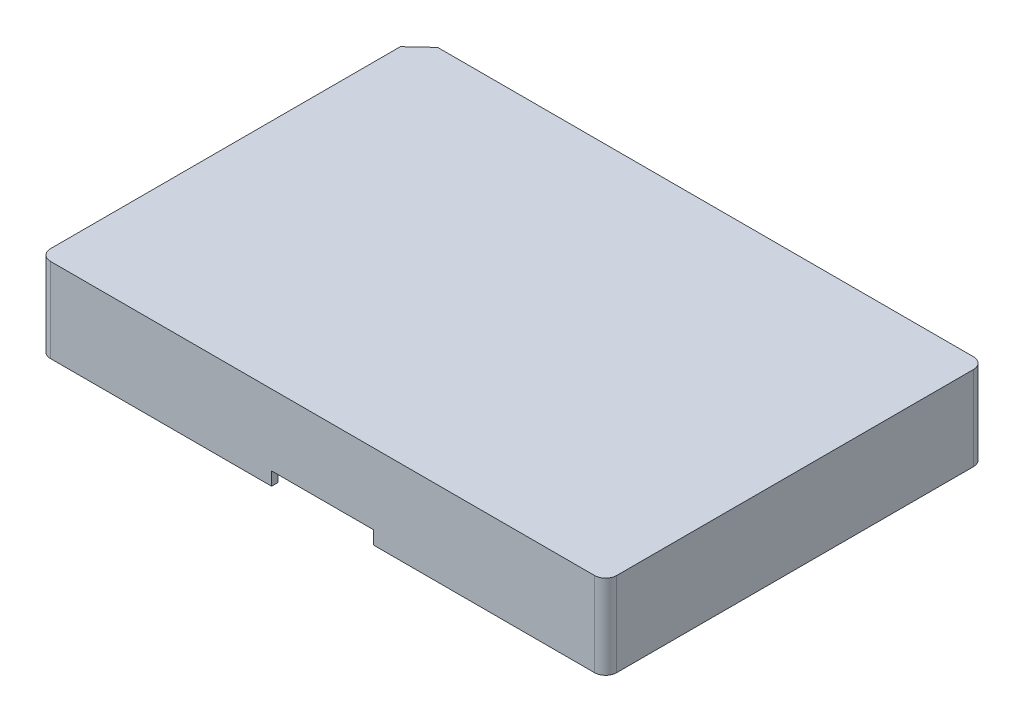
ISO-10303-21;
HEADER;
FILE_DESCRIPTION(('STEP AP214'),'2;1');
FILE_NAME('part.step','',(''),(''),'','','');
FILE_SCHEMA(('AUTOMOTIVE_DESIGN { 1 0 10303 214 1 1 1 1 }'));
ENDSEC;
DATA;
#1=APPLICATION_CONTEXT('core data for automotive mechanical design processes');
#2=APPLICATION_PROTOCOL_DEFINITION('international standard','automotive_design',2000,#1);
#3=PRODUCT_CONTEXT('',#1,'mechanical');
#4=PRODUCT('Part','Part','',(#3));
#5=PRODUCT_RELATED_PRODUCT_CATEGORY('part','',(#4));
#6=PRODUCT_DEFINITION_FORMATION('','',#4);
#7=PRODUCT_DEFINITION_CONTEXT('part definition',#1,'design');
#8=PRODUCT_DEFINITION('design','',#6,#7);
#9=PRODUCT_DEFINITION_SHAPE('','',#8);
#10=(LENGTH_UNIT() NAMED_UNIT(*) SI_UNIT(.MILLI.,.METRE.));
#11=(NAMED_UNIT(*) PLANE_ANGLE_UNIT() SI_UNIT($,.RADIAN.));
#12=(NAMED_UNIT(*) SI_UNIT($,.STERADIAN.) SOLID_ANGLE_UNIT());
#13=UNCERTAINTY_MEASURE_WITH_UNIT(LENGTH_MEASURE(1.E-05),#10,'distance_accuracy_value','');
#14=(GEOMETRIC_REPRESENTATION_CONTEXT(3) GLOBAL_UNCERTAINTY_ASSIGNED_CONTEXT((#13)) GLOBAL_UNIT_ASSIGNED_CONTEXT((#10,
#11,#12)) REPRESENTATION_CONTEXT('',''));
#15=CARTESIAN_POINT('',(0.,0.,0.));
#16=DIRECTION('',(0.,0.,1.));
#17=DIRECTION('',(1.,0.,0.));
#18=AXIS2_PLACEMENT_3D('',#15,#16,#17);
#19=CARTESIAN_POINT('',(0.,0.,0.));
#20=DIRECTION('',(0.,1.,0.));
#21=DIRECTION('',(0.,0.,1.));
#22=AXIS2_PLACEMENT_3D('',#19,#20,#21);
#23=PLANE('',#22);
#24=DIRECTION('',(0.,0.,-1.));
#25=VECTOR('',#24,1.);
#26=CARTESIAN_POINT('',(-6.91336789742875,0.,32.7853204422534));
#27=LINE('',#26,#25);
#28=CARTESIAN_POINT('',(-6.91336789742875,0.,118.285320442253));
#29=VERTEX_POINT('',#28);
#30=CARTESIAN_POINT('',(-6.91336789742875,0.,116.785320442253));
#31=VERTEX_POINT('',#30);
#32=EDGE_CURVE('E197',#29,#31,#27,.T.);
#33=ORIENTED_EDGE('',*,*,#32,.F.);
#34=DIRECTION('',(1.,0.,0.));
#35=VECTOR('',#34,1.);
#36=CARTESIAN_POINT('',(-59.2883678974287,0.,118.285320442253));
#37=LINE('',#36,#35);
#38=CARTESIAN_POINT('',(-56.7883678974287,0.,118.285320442253));
#39=VERTEX_POINT('',#38);
#40=EDGE_CURVE('E207',#39,#29,#37,.T.);
#41=ORIENTED_EDGE('',*,*,#40,.F.);
#42=CARTESIAN_POINT('',(-56.7883678974287,0.,115.785320442253));
#43=DIRECTION('',(0.,1.,0.));
#44=DIRECTION('',(0.,0.,1.));
#45=AXIS2_PLACEMENT_3D('',#42,#43,#44);
#46=CIRCLE('',#45,2.5);
#47=CARTESIAN_POINT('',(-59.2883678974287,0.,115.785320442253));
#48=VERTEX_POINT('',#47);
#49=EDGE_CURVE('E248',#39,#48,#46,.F.);
#50=ORIENTED_EDGE('',*,*,#49,.T.);
#51=DIRECTION('',(0.,0.,1.));
#52=VECTOR('',#51,1.);
#53=CARTESIAN_POINT('',(-59.2883678974288,0.,36.8507681403412));
#54=LINE('',#53,#52);
#55=CARTESIAN_POINT('',(-59.2883678974288,0.,36.8507681403412));
#56=VERTEX_POINT('',#55);
#57=EDGE_CURVE('E225',#56,#48,#54,.T.);
#58=ORIENTED_EDGE('',*,*,#57,.F.);
#59=DIRECTION('',(-0.731055268242871,0.,0.682318250360009));
#60=VECTOR('',#59,1.);
#61=CARTESIAN_POINT('',(-54.932531078049,0.,32.7853204422534));
#62=LINE('',#61,#60);
#63=CARTESIAN_POINT('',(-54.932531078049,0.,32.7853204422534));
#64=VERTEX_POINT('',#63);
#65=EDGE_CURVE('E352',#64,#56,#62,.T.);
#66=ORIENTED_EDGE('',*,*,#65,.F.);
#67=DIRECTION('',(-1.,0.,0.));
#68=VECTOR('',#67,1.);
#69=CARTESIAN_POINT('',(68.4616321025713,0.,32.7853204422534));
#70=LINE('',#69,#68);
#71=CARTESIAN_POINT('',(-6.91336789742875,0.,32.7853204422534));
#72=VERTEX_POINT('',#71);
#73=EDGE_CURVE('E223',#72,#64,#70,.T.);
#74=ORIENTED_EDGE('',*,*,#73,.F.);
#75=CARTESIAN_POINT('',(-6.91336789742875,0.,34.2853204422534));
#76=VERTEX_POINT('',#75);
#77=EDGE_CURVE('E212',#76,#72,#27,.T.);
#78=ORIENTED_EDGE('',*,*,#77,.F.);
#79=DIRECTION('',(-1.,0.,0.));
#80=VECTOR('',#79,1.);
#81=CARTESIAN_POINT('',(68.4616321025713,0.,34.2853204422534));
#82=LINE('',#81,#80);
#83=CARTESIAN_POINT('',(-54.3412863071186,0.,34.2853204422534));
#84=VERTEX_POINT('',#83);
#85=EDGE_CURVE('E358',#76,#84,#82,.T.);
#86=ORIENTED_EDGE('',*,*,#85,.T.);
#87=DIRECTION('',(-0.731055268242871,0.,0.682318250360009));
#88=VECTOR('',#87,1.);
#89=CARTESIAN_POINT('',(-53.909053702509,0.,33.8819033446177));
#90=LINE('',#89,#88);
#91=CARTESIAN_POINT('',(-57.7883678974288,0.,37.5025965932095));
#92=VERTEX_POINT('',#91);
#93=EDGE_CURVE('E310',#84,#92,#90,.T.);
#94=ORIENTED_EDGE('',*,*,#93,.T.);
#95=DIRECTION('',(0.,0.,1.));
#96=VECTOR('',#95,1.);
#97=CARTESIAN_POINT('',(-57.7883678974288,0.,36.8507681403412));
#98=LINE('',#97,#96);
#99=CARTESIAN_POINT('',(-57.7883678974287,0.,115.785320442253));
#100=VERTEX_POINT('',#99);
#101=EDGE_CURVE('E356',#92,#100,#98,.T.);
#102=ORIENTED_EDGE('',*,*,#101,.T.);
#103=CARTESIAN_POINT('',(-56.7883678974287,0.,115.785320442253));
#104=DIRECTION('',(0.,1.,0.));
#105=DIRECTION('',(0.,0.,1.));
#106=AXIS2_PLACEMENT_3D('',#103,#104,#105);
#107=CIRCLE('',#106,1.);
#108=CARTESIAN_POINT('',(-56.7883678974287,0.,116.785320442253));
#109=VERTEX_POINT('',#108);
#110=EDGE_CURVE('E327',#109,#100,#107,.F.);
#111=ORIENTED_EDGE('',*,*,#110,.F.);
#112=DIRECTION('',(1.,0.,0.));
#113=VECTOR('',#112,1.);
#114=CARTESIAN_POINT('',(-59.2883678974287,0.,116.785320442253));
#115=LINE('',#114,#113);
#116=EDGE_CURVE('E210',#109,#31,#115,.T.);
#117=ORIENTED_EDGE('',*,*,#116,.T.);
#118=EDGE_LOOP('',(#33,#41,#50,#58,#66,#74,#78,#86,#94,#102,#111,#117));
#119=FACE_BOUND('',#118,.T.);
#120=ADVANCED_FACE('F34',(#119),#23,.F.);
#121=CARTESIAN_POINT('',(-59.2883678974287,19.,118.285320442253));
#122=DIRECTION('',(0.,0.,-1.));
#123=DIRECTION('',(-1.,0.,0.));
#124=AXIS2_PLACEMENT_3D('',#121,#122,#123);
#125=PLANE('',#124);
#126=DIRECTION('',(0.,-1.,0.));
#127=VECTOR('',#126,1.);
#128=CARTESIAN_POINT('',(-6.91336789742875,3.,118.285320442253));
#129=LINE('',#128,#127);
#130=CARTESIAN_POINT('',(-6.91336789742875,3.,118.285320442253));
#131=VERTEX_POINT('',#130);
#132=EDGE_CURVE('E194',#131,#29,#129,.T.);
#133=ORIENTED_EDGE('',*,*,#132,.F.);
#134=DIRECTION('',(1.,0.,0.));
#135=VECTOR('',#134,1.);
#136=CARTESIAN_POINT('',(-6.91336789742875,3.,118.285320442253));
#137=LINE('',#136,#135);
#138=CARTESIAN_POINT('',(16.0866321025713,3.00000000000001,118.285320442253));
#139=VERTEX_POINT('',#138);
#140=EDGE_CURVE('E289',#131,#139,#137,.T.);
#141=ORIENTED_EDGE('',*,*,#140,.T.);
#142=DIRECTION('',(0.,-1.,0.));
#143=VECTOR('',#142,1.);
#144=CARTESIAN_POINT('',(16.0866321025713,3.00000000000001,118.285320442253));
#145=LINE('',#144,#143);
#146=CARTESIAN_POINT('',(16.0866321025713,0.,118.285320442253));
#147=VERTEX_POINT('',#146);
#148=EDGE_CURVE('E202',#139,#147,#145,.T.);
#149=ORIENTED_EDGE('',*,*,#148,.T.);
#150=CARTESIAN_POINT('',(65.9616321025712,0.,118.285320442253));
#151=VERTEX_POINT('',#150);
#152=EDGE_CURVE('E220',#147,#151,#37,.T.);
#153=ORIENTED_EDGE('',*,*,#152,.T.);
#154=DIRECTION('',(0.,-1.,0.));
#155=VECTOR('',#154,1.);
#156=CARTESIAN_POINT('',(65.9616321025712,19.,118.285320442253));
#157=LINE('',#156,#155);
#158=CARTESIAN_POINT('',(65.9616321025712,19.,118.285320442253));
#159=VERTEX_POINT('',#158);
#160=EDGE_CURVE('E240',#151,#159,#157,.F.);
#161=ORIENTED_EDGE('',*,*,#160,.T.);
#162=DIRECTION('',(1.,0.,0.));
#163=VECTOR('',#162,1.);
#164=CARTESIAN_POINT('',(-59.2883678974287,19.,118.285320442253));
#165=LINE('',#164,#163);
#166=CARTESIAN_POINT('',(-56.7883678974287,19.,118.285320442253));
#167=VERTEX_POINT('',#166);
#168=EDGE_CURVE('E376',#167,#159,#165,.T.);
#169=ORIENTED_EDGE('',*,*,#168,.F.);
#170=DIRECTION('',(0.,-1.,0.));
#171=VECTOR('',#170,1.);
#172=CARTESIAN_POINT('',(-56.7883678974287,19.,118.285320442253));
#173=LINE('',#172,#171);
#174=EDGE_CURVE('E218',#167,#39,#173,.T.);
#175=ORIENTED_EDGE('',*,*,#174,.T.);
#176=ORIENTED_EDGE('',*,*,#40,.T.);
#177=EDGE_LOOP('',(#133,#141,#149,#153,#161,#169,#175,#176));
#178=FACE_BOUND('',#177,.T.);
#179=ADVANCED_FACE('F215',(#178),#125,.F.);
#180=CARTESIAN_POINT('',(68.4616321025713,19.,32.7853204422534));
#181=DIRECTION('',(0.,0.,1.));
#182=DIRECTION('',(1.,0.,0.));
#183=AXIS2_PLACEMENT_3D('',#180,#181,#182);
#184=PLANE('',#183);
#185=DIRECTION('',(0.,1.,0.));
#186=VECTOR('',#185,1.);
#187=CARTESIAN_POINT('',(-6.91336789742875,19.,32.7853204422534));
#188=LINE('',#187,#186);
#189=CARTESIAN_POINT('',(-6.91336789742875,3.,32.7853204422534));
#190=VERTEX_POINT('',#189);
#191=EDGE_CURVE('E288',#72,#190,#188,.T.);
#192=ORIENTED_EDGE('',*,*,#191,.F.);
#193=ORIENTED_EDGE('',*,*,#73,.T.);
#194=DIRECTION('',(0.,-1.,0.));
#195=VECTOR('',#194,1.);
#196=CARTESIAN_POINT('',(-54.932531078049,19.,32.7853204422534));
#197=LINE('',#196,#195);
#198=CARTESIAN_POINT('',(-54.932531078049,19.,32.7853204422534));
#199=VERTEX_POINT('',#198);
#200=EDGE_CURVE('E233',#199,#64,#197,.T.);
#201=ORIENTED_EDGE('',*,*,#200,.F.);
#202=DIRECTION('',(-1.,0.,0.));
#203=VECTOR('',#202,1.);
#204=CARTESIAN_POINT('',(68.4616321025713,19.,32.7853204422534));
#205=LINE('',#204,#203);
#206=CARTESIAN_POINT('',(65.9616321025712,19.,32.7853204422534));
#207=VERTEX_POINT('',#206);
#208=EDGE_CURVE('E237',#207,#199,#205,.T.);
#209=ORIENTED_EDGE('',*,*,#208,.F.);
#210=DIRECTION('',(0.,-1.,0.));
#211=VECTOR('',#210,1.);
#212=CARTESIAN_POINT('',(65.9616321025712,19.,32.7853204422534));
#213=LINE('',#212,#211);
#214=CARTESIAN_POINT('',(65.9616321025712,0.,32.7853204422534));
#215=VERTEX_POINT('',#214);
#216=EDGE_CURVE('E258',#207,#215,#213,.T.);
#217=ORIENTED_EDGE('',*,*,#216,.T.);
#218=CARTESIAN_POINT('',(16.0866321025713,0.,32.7853204422534));
#219=VERTEX_POINT('',#218);
#220=EDGE_CURVE('E229',#215,#219,#70,.T.);
#221=ORIENTED_EDGE('',*,*,#220,.T.);
#222=DIRECTION('',(0.,1.,0.));
#223=VECTOR('',#222,1.);
#224=CARTESIAN_POINT('',(16.0866321025712,19.,32.7853204422534));
#225=LINE('',#224,#223);
#226=CARTESIAN_POINT('',(16.0866321025713,3.00000000000001,32.7853204422534));
#227=VERTEX_POINT('',#226);
#228=EDGE_CURVE('E305',#219,#227,#225,.T.);
#229=ORIENTED_EDGE('',*,*,#228,.T.);
#230=DIRECTION('',(-1.,0.,0.));
#231=VECTOR('',#230,1.);
#232=CARTESIAN_POINT('',(68.4616321025713,3.00000000000002,32.7853204422534));
#233=LINE('',#232,#231);
#234=EDGE_CURVE('E301',#227,#190,#233,.T.);
#235=ORIENTED_EDGE('',*,*,#234,.T.);
#236=EDGE_LOOP('',(#192,#193,#201,#209,#217,#221,#229,#235));
#237=FACE_BOUND('',#236,.T.);
#238=ADVANCED_FACE('F413',(#237),#184,.F.);
#239=CARTESIAN_POINT('',(-59.2883678974287,19.,116.785320442253));
#240=DIRECTION('',(0.,0.,-1.));
#241=DIRECTION('',(-1.,0.,0.));
#242=AXIS2_PLACEMENT_3D('',#239,#240,#241);
#243=PLANE('',#242);
#244=DIRECTION('',(1.,0.,0.));
#245=VECTOR('',#244,1.);
#246=CARTESIAN_POINT('',(-59.2883678974287,2.99999999999999,116.785320442253));
#247=LINE('',#246,#245);
#248=CARTESIAN_POINT('',(-6.91336789742875,3.,116.785320442253));
#249=VERTEX_POINT('',#248);
#250=CARTESIAN_POINT('',(16.0866321025713,3.00000000000001,116.785320442253));
#251=VERTEX_POINT('',#250);
#252=EDGE_CURVE('E211',#249,#251,#247,.T.);
#253=ORIENTED_EDGE('',*,*,#252,.F.);
#254=DIRECTION('',(0.,-1.,0.));
#255=VECTOR('',#254,1.);
#256=CARTESIAN_POINT('',(-6.91336789742874,19.,116.785320442253));
#257=LINE('',#256,#255);
#258=EDGE_CURVE('E307',#249,#31,#257,.T.);
#259=ORIENTED_EDGE('',*,*,#258,.T.);
#260=ORIENTED_EDGE('',*,*,#116,.F.);
#261=DIRECTION('',(0.,1.,0.));
#262=VECTOR('',#261,1.);
#263=CARTESIAN_POINT('',(-56.7883678974287,19.,116.785320442253));
#264=LINE('',#263,#262);
#265=CARTESIAN_POINT('',(-56.7883678974287,17.5,116.785320442253));
#266=VERTEX_POINT('',#265);
#267=EDGE_CURVE('E343',#266,#109,#264,.F.);
#268=ORIENTED_EDGE('',*,*,#267,.F.);
#269=DIRECTION('',(1.,0.,0.));
#270=VECTOR('',#269,1.);
#271=CARTESIAN_POINT('',(-59.2883678974287,17.5,116.785320442253));
#272=LINE('',#271,#270);
#273=CARTESIAN_POINT('',(65.9616321025712,17.5,116.785320442253));
#274=VERTEX_POINT('',#273);
#275=EDGE_CURVE('E330',#266,#274,#272,.T.);
#276=ORIENTED_EDGE('',*,*,#275,.T.);
#277=DIRECTION('',(0.,1.,0.));
#278=VECTOR('',#277,1.);
#279=CARTESIAN_POINT('',(65.9616321025712,19.,116.785320442253));
#280=LINE('',#279,#278);
#281=CARTESIAN_POINT('',(65.9616321025712,0.,116.785320442253));
#282=VERTEX_POINT('',#281);
#283=EDGE_CURVE('E314',#282,#274,#280,.T.);
#284=ORIENTED_EDGE('',*,*,#283,.F.);
#285=CARTESIAN_POINT('',(16.0866321025713,0.,116.785320442253));
#286=VERTEX_POINT('',#285);
#287=EDGE_CURVE('E367',#286,#282,#115,.T.);
#288=ORIENTED_EDGE('',*,*,#287,.F.);
#289=DIRECTION('',(0.,-1.,0.));
#290=VECTOR('',#289,1.);
#291=CARTESIAN_POINT('',(16.0866321025712,19.,116.785320442253));
#292=LINE('',#291,#290);
#293=EDGE_CURVE('E303',#251,#286,#292,.T.);
#294=ORIENTED_EDGE('',*,*,#293,.F.);
#295=EDGE_LOOP('',(#253,#259,#260,#268,#276,#284,#288,#294));
#296=FACE_BOUND('',#295,.T.);
#297=ADVANCED_FACE('F439',(#296),#243,.T.);
#298=CARTESIAN_POINT('',(68.4616321025713,19.,34.2853204422534));
#299=DIRECTION('',(0.,0.,1.));
#300=DIRECTION('',(1.,0.,0.));
#301=AXIS2_PLACEMENT_3D('',#298,#299,#300);
#302=PLANE('',#301);
#303=ORIENTED_EDGE('',*,*,#85,.F.);
#304=DIRECTION('',(0.,1.,0.));
#305=VECTOR('',#304,1.);
#306=CARTESIAN_POINT('',(-6.91336789742875,19.,34.2853204422534));
#307=LINE('',#306,#305);
#308=CARTESIAN_POINT('',(-6.91336789742875,3.,34.2853204422534));
#309=VERTEX_POINT('',#308);
#310=EDGE_CURVE('E11',#76,#309,#307,.T.);
#311=ORIENTED_EDGE('',*,*,#310,.T.);
#312=DIRECTION('',(-1.,0.,0.));
#313=VECTOR('',#312,1.);
#314=CARTESIAN_POINT('',(68.4616321025713,3.00000000000002,34.2853204422534));
#315=LINE('',#314,#313);
#316=CARTESIAN_POINT('',(16.0866321025712,3.00000000000001,34.2853204422534));
#317=VERTEX_POINT('',#316);
#318=EDGE_CURVE('E266',#317,#309,#315,.T.);
#319=ORIENTED_EDGE('',*,*,#318,.F.);
#320=DIRECTION('',(0.,1.,0.));
#321=VECTOR('',#320,1.);
#322=CARTESIAN_POINT('',(16.0866321025712,19.,34.2853204422534));
#323=LINE('',#322,#321);
#324=CARTESIAN_POINT('',(16.0866321025713,0.,34.2853204422534));
#325=VERTEX_POINT('',#324);
#326=EDGE_CURVE('E42',#325,#317,#323,.T.);
#327=ORIENTED_EDGE('',*,*,#326,.F.);
#328=CARTESIAN_POINT('',(65.9616321025712,0.,34.2853204422534));
#329=VERTEX_POINT('',#328);
#330=EDGE_CURVE('E320',#329,#325,#82,.T.);
#331=ORIENTED_EDGE('',*,*,#330,.F.);
#332=DIRECTION('',(0.,1.,0.));
#333=VECTOR('',#332,1.);
#334=CARTESIAN_POINT('',(65.9616321025712,19.,34.2853204422534));
#335=LINE('',#334,#333);
#336=CARTESIAN_POINT('',(65.9616321025712,17.5,34.2853204422534));
#337=VERTEX_POINT('',#336);
#338=EDGE_CURVE('E333',#337,#329,#335,.F.);
#339=ORIENTED_EDGE('',*,*,#338,.F.);
#340=DIRECTION('',(-1.,0.,0.));
#341=VECTOR('',#340,1.);
#342=CARTESIAN_POINT('',(68.4616321025713,17.5,34.2853204422534));
#343=LINE('',#342,#341);
#344=CARTESIAN_POINT('',(-54.3412863071186,17.5,34.2853204422534));
#345=VERTEX_POINT('',#344);
#346=EDGE_CURVE('E323',#337,#345,#343,.T.);
#347=ORIENTED_EDGE('',*,*,#346,.T.);
#348=DIRECTION('',(0.,-1.,0.));
#349=VECTOR('',#348,1.);
#350=CARTESIAN_POINT('',(-54.3412863071186,19.,34.2853204422534));
#351=LINE('',#350,#349);
#352=EDGE_CURVE('E315',#345,#84,#351,.T.);
#353=ORIENTED_EDGE('',*,*,#352,.T.);
#354=EDGE_LOOP('',(#303,#311,#319,#327,#331,#339,#347,#353));
#355=FACE_BOUND('',#354,.T.);
#356=ADVANCED_FACE('F278',(#355),#302,.T.);
#357=ORIENTED_EDGE('',*,*,#152,.F.);
#358=DIRECTION('',(0.,0.,-1.));
#359=VECTOR('',#358,1.);
#360=CARTESIAN_POINT('',(16.0866321025713,0.,32.7853204422534));
#361=LINE('',#360,#359);
#362=EDGE_CURVE('E297',#147,#286,#361,.T.);
#363=ORIENTED_EDGE('',*,*,#362,.T.);
#364=ORIENTED_EDGE('',*,*,#287,.T.);
#365=CARTESIAN_POINT('',(65.9616321025712,0.,115.785320442253));
#366=DIRECTION('',(0.,1.,0.));
#367=DIRECTION('',(0.,0.,1.));
#368=AXIS2_PLACEMENT_3D('',#365,#366,#367);
#369=CIRCLE('',#368,1.);
#370=CARTESIAN_POINT('',(66.9616321025712,0.,115.785320442253));
#371=VERTEX_POINT('',#370);
#372=EDGE_CURVE('E345',#371,#282,#369,.F.);
#373=ORIENTED_EDGE('',*,*,#372,.F.);
#374=DIRECTION('',(0.,0.,-1.));
#375=VECTOR('',#374,1.);
#376=CARTESIAN_POINT('',(66.9616321025712,0.,118.285320442253));
#377=LINE('',#376,#375);
#378=CARTESIAN_POINT('',(66.9616321025712,0.,35.2853204422534));
#379=VERTEX_POINT('',#378);
#380=EDGE_CURVE('E361',#371,#379,#377,.T.);
#381=ORIENTED_EDGE('',*,*,#380,.T.);
#382=CARTESIAN_POINT('',(65.9616321025712,0.,35.2853204422534));
#383=DIRECTION('',(0.,1.,0.));
#384=DIRECTION('',(0.,0.,1.));
#385=AXIS2_PLACEMENT_3D('',#382,#383,#384);
#386=CIRCLE('',#385,1.);
#387=EDGE_CURVE('E359',#329,#379,#386,.F.);
#388=ORIENTED_EDGE('',*,*,#387,.F.);
#389=ORIENTED_EDGE('',*,*,#330,.T.);
#390=EDGE_CURVE('E273',#325,#219,#361,.T.);
#391=ORIENTED_EDGE('',*,*,#390,.T.);
#392=ORIENTED_EDGE('',*,*,#220,.F.);
#393=CARTESIAN_POINT('',(65.9616321025712,0.,35.2853204422534));
#394=DIRECTION('',(0.,1.,0.));
#395=DIRECTION('',(0.,0.,1.));
#396=AXIS2_PLACEMENT_3D('',#393,#394,#395);
#397=CIRCLE('',#396,2.5);
#398=CARTESIAN_POINT('',(68.4616321025713,0.,35.2853204422534));
#399=VERTEX_POINT('',#398);
#400=EDGE_CURVE('E246',#215,#399,#397,.F.);
#401=ORIENTED_EDGE('',*,*,#400,.T.);
#402=DIRECTION('',(0.,0.,-1.));
#403=VECTOR('',#402,1.);
#404=CARTESIAN_POINT('',(68.4616321025713,0.,118.285320442253));
#405=LINE('',#404,#403);
#406=CARTESIAN_POINT('',(68.4616321025713,0.,115.785320442253));
#407=VERTEX_POINT('',#406);
#408=EDGE_CURVE('E219',#407,#399,#405,.T.);
#409=ORIENTED_EDGE('',*,*,#408,.F.);
#410=CARTESIAN_POINT('',(65.9616321025712,0.,115.785320442253));
#411=DIRECTION('',(0.,1.,0.));
#412=DIRECTION('',(0.,0.,1.));
#413=AXIS2_PLACEMENT_3D('',#410,#411,#412);
#414=CIRCLE('',#413,2.5);
#415=EDGE_CURVE('E243',#407,#151,#414,.F.);
#416=ORIENTED_EDGE('',*,*,#415,.T.);
#417=EDGE_LOOP('',(#357,#363,#364,#373,#381,#388,#389,#391,#392,#401,#409,#416));
#418=FACE_BOUND('',#417,.T.);
#419=ADVANCED_FACE('F419',(#418),#23,.F.);
#420=CARTESIAN_POINT('',(-54.932531078049,19.,32.7853204422534));
#421=DIRECTION('',(0.682318250360009,0.,0.731055268242871));
#422=DIRECTION('',(0.731055268242871,0.,-0.682318250360009));
#423=AXIS2_PLACEMENT_3D('',#420,#421,#422);
#424=PLANE('',#423);
#425=ORIENTED_EDGE('',*,*,#65,.T.);
#426=DIRECTION('',(0.,-1.,0.));
#427=VECTOR('',#426,1.);
#428=CARTESIAN_POINT('',(-59.2883678974288,19.,36.8507681403412));
#429=LINE('',#428,#427);
#430=CARTESIAN_POINT('',(-59.2883678974288,19.,36.8507681403412));
#431=VERTEX_POINT('',#430);
#432=EDGE_CURVE('E236',#431,#56,#429,.T.);
#433=ORIENTED_EDGE('',*,*,#432,.F.);
#434=DIRECTION('',(-0.731055268242871,0.,0.682318250360009));
#435=VECTOR('',#434,1.);
#436=CARTESIAN_POINT('',(-54.932531078049,19.,32.7853204422534));
#437=LINE('',#436,#435);
#438=EDGE_CURVE('E232',#199,#431,#437,.T.);
#439=ORIENTED_EDGE('',*,*,#438,.F.);
#440=ORIENTED_EDGE('',*,*,#200,.T.);
#441=EDGE_LOOP('',(#425,#433,#439,#440));
#442=FACE_BOUND('',#441,.T.);
#443=ADVANCED_FACE('F417',(#442),#424,.F.);
#444=CARTESIAN_POINT('',(-59.2883678974288,19.,36.8507681403412));
#445=DIRECTION('',(1.,0.,0.));
#446=DIRECTION('',(0.,0.,-1.));
#447=AXIS2_PLACEMENT_3D('',#444,#445,#446);
#448=PLANE('',#447);
#449=ORIENTED_EDGE('',*,*,#57,.T.);
#450=DIRECTION('',(0.,-1.,0.));
#451=VECTOR('',#450,1.);
#452=CARTESIAN_POINT('',(-59.2883678974287,19.,115.785320442253));
#453=LINE('',#452,#451);
#454=CARTESIAN_POINT('',(-59.2883678974287,19.,115.785320442253));
#455=VERTEX_POINT('',#454);
#456=EDGE_CURVE('E250',#48,#455,#453,.F.);
#457=ORIENTED_EDGE('',*,*,#456,.T.);
#458=DIRECTION('',(0.,0.,1.));
#459=VECTOR('',#458,1.);
#460=CARTESIAN_POINT('',(-59.2883678974288,19.,36.8507681403412));
#461=LINE('',#460,#459);
#462=EDGE_CURVE('E373',#431,#455,#461,.T.);
#463=ORIENTED_EDGE('',*,*,#462,.F.);
#464=ORIENTED_EDGE('',*,*,#432,.T.);
#465=EDGE_LOOP('',(#449,#457,#463,#464));
#466=FACE_BOUND('',#465,.T.);
#467=ADVANCED_FACE('F389',(#466),#448,.F.);
#468=CARTESIAN_POINT('',(68.4616321025713,19.,118.285320442253));
#469=DIRECTION('',(-1.,0.,0.));
#470=DIRECTION('',(0.,0.,1.));
#471=AXIS2_PLACEMENT_3D('',#468,#469,#470);
#472=PLANE('',#471);
#473=ORIENTED_EDGE('',*,*,#408,.T.);
#474=DIRECTION('',(0.,-1.,0.));
#475=VECTOR('',#474,1.);
#476=CARTESIAN_POINT('',(68.4616321025713,19.,35.2853204422534));
#477=LINE('',#476,#475);
#478=CARTESIAN_POINT('',(68.4616321025713,19.,35.2853204422534));
#479=VERTEX_POINT('',#478);
#480=EDGE_CURVE('E264',#399,#479,#477,.F.);
#481=ORIENTED_EDGE('',*,*,#480,.T.);
#482=DIRECTION('',(0.,0.,-1.));
#483=VECTOR('',#482,1.);
#484=CARTESIAN_POINT('',(68.4616321025713,19.,118.285320442253));
#485=LINE('',#484,#483);
#486=CARTESIAN_POINT('',(68.4616321025713,19.,115.785320442253));
#487=VERTEX_POINT('',#486);
#488=EDGE_CURVE('E379',#487,#479,#485,.T.);
#489=ORIENTED_EDGE('',*,*,#488,.F.);
#490=DIRECTION('',(0.,-1.,0.));
#491=VECTOR('',#490,1.);
#492=CARTESIAN_POINT('',(68.4616321025713,19.,115.785320442253));
#493=LINE('',#492,#491);
#494=EDGE_CURVE('E261',#487,#407,#493,.T.);
#495=ORIENTED_EDGE('',*,*,#494,.T.);
#496=EDGE_LOOP('',(#473,#481,#489,#495));
#497=FACE_BOUND('',#496,.T.);
#498=ADVANCED_FACE('F404',(#497),#472,.F.);
#499=CARTESIAN_POINT('',(0.,19.,0.));
#500=DIRECTION('',(0.,1.,0.));
#501=DIRECTION('',(0.,0.,1.));
#502=AXIS2_PLACEMENT_3D('',#499,#500,#501);
#503=PLANE('',#502);
#504=ORIENTED_EDGE('',*,*,#462,.T.);
#505=CARTESIAN_POINT('',(-56.7883678974287,19.,115.785320442253));
#506=DIRECTION('',(0.,1.,0.));
#507=DIRECTION('',(0.,0.,1.));
#508=AXIS2_PLACEMENT_3D('',#505,#506,#507);
#509=CIRCLE('',#508,2.5);
#510=EDGE_CURVE('E256',#455,#167,#509,.T.);
#511=ORIENTED_EDGE('',*,*,#510,.T.);
#512=ORIENTED_EDGE('',*,*,#168,.T.);
#513=CARTESIAN_POINT('',(65.9616321025712,19.,115.785320442253));
#514=DIRECTION('',(0.,1.,0.));
#515=DIRECTION('',(0.,0.,1.));
#516=AXIS2_PLACEMENT_3D('',#513,#514,#515);
#517=CIRCLE('',#516,2.5);
#518=EDGE_CURVE('E252',#159,#487,#517,.T.);
#519=ORIENTED_EDGE('',*,*,#518,.T.);
#520=ORIENTED_EDGE('',*,*,#488,.T.);
#521=CARTESIAN_POINT('',(65.9616321025712,19.,35.2853204422534));
#522=DIRECTION('',(0.,1.,0.));
#523=DIRECTION('',(0.,0.,1.));
#524=AXIS2_PLACEMENT_3D('',#521,#522,#523);
#525=CIRCLE('',#524,2.5);
#526=EDGE_CURVE('E254',#479,#207,#525,.T.);
#527=ORIENTED_EDGE('',*,*,#526,.T.);
#528=ORIENTED_EDGE('',*,*,#208,.T.);
#529=ORIENTED_EDGE('',*,*,#438,.T.);
#530=EDGE_LOOP('',(#504,#511,#512,#519,#520,#527,#528,#529));
#531=FACE_BOUND('',#530,.T.);
#532=ADVANCED_FACE('F394',(#531),#503,.T.);
#533=CARTESIAN_POINT('',(-56.7883678974287,19.,115.785320442253));
#534=DIRECTION('',(0.,-1.,0.));
#535=DIRECTION('',(0.,0.,-1.));
#536=AXIS2_PLACEMENT_3D('',#533,#534,#535);
#537=CYLINDRICAL_SURFACE('',#536,2.5);
#538=ORIENTED_EDGE('',*,*,#510,.F.);
#539=ORIENTED_EDGE('',*,*,#456,.F.);
#540=ORIENTED_EDGE('',*,*,#49,.F.);
#541=ORIENTED_EDGE('',*,*,#174,.F.);
#542=EDGE_LOOP('',(#538,#539,#540,#541));
#543=FACE_BOUND('',#542,.T.);
#544=ADVANCED_FACE('F392',(#543),#537,.T.);
#545=CARTESIAN_POINT('',(65.9616321025712,19.,35.2853204422534));
#546=DIRECTION('',(0.,-1.,0.));
#547=DIRECTION('',(0.,0.,-1.));
#548=AXIS2_PLACEMENT_3D('',#545,#546,#547);
#549=CYLINDRICAL_SURFACE('',#548,2.5);
#550=ORIENTED_EDGE('',*,*,#526,.F.);
#551=ORIENTED_EDGE('',*,*,#480,.F.);
#552=ORIENTED_EDGE('',*,*,#400,.F.);
#553=ORIENTED_EDGE('',*,*,#216,.F.);
#554=EDGE_LOOP('',(#550,#551,#552,#553));
#555=FACE_BOUND('',#554,.T.);
#556=ADVANCED_FACE('F408',(#555),#549,.T.);
#557=CARTESIAN_POINT('',(65.9616321025712,19.,115.785320442253));
#558=DIRECTION('',(0.,-1.,0.));
#559=DIRECTION('',(0.,0.,-1.));
#560=AXIS2_PLACEMENT_3D('',#557,#558,#559);
#561=CYLINDRICAL_SURFACE('',#560,2.5);
#562=ORIENTED_EDGE('',*,*,#518,.F.);
#563=ORIENTED_EDGE('',*,*,#160,.F.);
#564=ORIENTED_EDGE('',*,*,#415,.F.);
#565=ORIENTED_EDGE('',*,*,#494,.F.);
#566=EDGE_LOOP('',(#562,#563,#564,#565));
#567=FACE_BOUND('',#566,.T.);
#568=ADVANCED_FACE('F36',(#567),#561,.T.);
#569=CARTESIAN_POINT('',(-53.909053702509,19.,33.8819033446177));
#570=DIRECTION('',(0.682318250360009,0.,0.731055268242871));
#571=DIRECTION('',(0.731055268242871,0.,-0.682318250360009));
#572=AXIS2_PLACEMENT_3D('',#569,#570,#571);
#573=PLANE('',#572);
#574=ORIENTED_EDGE('',*,*,#93,.F.);
#575=ORIENTED_EDGE('',*,*,#352,.F.);
#576=DIRECTION('',(-0.731055268242871,0.,0.682318250360009));
#577=VECTOR('',#576,1.);
#578=CARTESIAN_POINT('',(-53.909053702509,17.5,33.8819033446177));
#579=LINE('',#578,#577);
#580=CARTESIAN_POINT('',(-57.7883678974288,17.5,37.5025965932095));
#581=VERTEX_POINT('',#580);
#582=EDGE_CURVE('E316',#345,#581,#579,.T.);
#583=ORIENTED_EDGE('',*,*,#582,.T.);
#584=DIRECTION('',(0.,-1.,0.));
#585=VECTOR('',#584,1.);
#586=CARTESIAN_POINT('',(-57.7883678974288,19.,37.5025965932095));
#587=LINE('',#586,#585);
#588=EDGE_CURVE('E311',#581,#92,#587,.T.);
#589=ORIENTED_EDGE('',*,*,#588,.T.);
#590=EDGE_LOOP('',(#574,#575,#583,#589));
#591=FACE_BOUND('',#590,.T.);
#592=ADVANCED_FACE('F453',(#591),#573,.T.);
#593=CARTESIAN_POINT('',(-57.7883678974288,19.,36.8507681403412));
#594=DIRECTION('',(1.,0.,0.));
#595=DIRECTION('',(0.,0.,-1.));
#596=AXIS2_PLACEMENT_3D('',#593,#594,#595);
#597=PLANE('',#596);
#598=ORIENTED_EDGE('',*,*,#101,.F.);
#599=ORIENTED_EDGE('',*,*,#588,.F.);
#600=DIRECTION('',(0.,0.,1.));
#601=VECTOR('',#600,1.);
#602=CARTESIAN_POINT('',(-57.7883678974288,17.5,36.8507681403412));
#603=LINE('',#602,#601);
#604=CARTESIAN_POINT('',(-57.7883678974287,17.5,115.785320442253));
#605=VERTEX_POINT('',#604);
#606=EDGE_CURVE('E319',#581,#605,#603,.T.);
#607=ORIENTED_EDGE('',*,*,#606,.T.);
#608=DIRECTION('',(0.,1.,0.));
#609=VECTOR('',#608,1.);
#610=CARTESIAN_POINT('',(-57.7883678974287,19.,115.785320442253));
#611=LINE('',#610,#609);
#612=EDGE_CURVE('E324',#100,#605,#611,.T.);
#613=ORIENTED_EDGE('',*,*,#612,.F.);
#614=EDGE_LOOP('',(#598,#599,#607,#613));
#615=FACE_BOUND('',#614,.T.);
#616=ADVANCED_FACE('F457',(#615),#597,.T.);
#617=CARTESIAN_POINT('',(66.9616321025712,19.,118.285320442253));
#618=DIRECTION('',(-1.,0.,0.));
#619=DIRECTION('',(0.,0.,1.));
#620=AXIS2_PLACEMENT_3D('',#617,#618,#619);
#621=PLANE('',#620);
#622=ORIENTED_EDGE('',*,*,#380,.F.);
#623=DIRECTION('',(0.,1.,0.));
#624=VECTOR('',#623,1.);
#625=CARTESIAN_POINT('',(66.9616321025712,19.,115.785320442253));
#626=LINE('',#625,#624);
#627=CARTESIAN_POINT('',(66.9616321025712,17.5,115.785320442253));
#628=VERTEX_POINT('',#627);
#629=EDGE_CURVE('E347',#628,#371,#626,.F.);
#630=ORIENTED_EDGE('',*,*,#629,.F.);
#631=DIRECTION('',(0.,0.,-1.));
#632=VECTOR('',#631,1.);
#633=CARTESIAN_POINT('',(66.9616321025712,17.5,118.285320442253));
#634=LINE('',#633,#632);
#635=CARTESIAN_POINT('',(66.9616321025712,17.5,35.2853204422534));
#636=VERTEX_POINT('',#635);
#637=EDGE_CURVE('E337',#628,#636,#634,.T.);
#638=ORIENTED_EDGE('',*,*,#637,.T.);
#639=DIRECTION('',(0.,1.,0.));
#640=VECTOR('',#639,1.);
#641=CARTESIAN_POINT('',(66.9616321025712,19.,35.2853204422534));
#642=LINE('',#641,#640);
#643=EDGE_CURVE('E350',#379,#636,#642,.T.);
#644=ORIENTED_EDGE('',*,*,#643,.F.);
#645=EDGE_LOOP('',(#622,#630,#638,#644));
#646=FACE_BOUND('',#645,.T.);
#647=ADVANCED_FACE('F463',(#646),#621,.T.);
#648=CARTESIAN_POINT('',(0.,17.5,0.));
#649=DIRECTION('',(0.,1.,0.));
#650=DIRECTION('',(0.,0.,1.));
#651=AXIS2_PLACEMENT_3D('',#648,#649,#650);
#652=PLANE('',#651);
#653=ORIENTED_EDGE('',*,*,#606,.F.);
#654=ORIENTED_EDGE('',*,*,#582,.F.);
#655=ORIENTED_EDGE('',*,*,#346,.F.);
#656=CARTESIAN_POINT('',(65.9616321025712,17.5,35.2853204422534));
#657=DIRECTION('',(0.,1.,0.));
#658=DIRECTION('',(0.,0.,1.));
#659=AXIS2_PLACEMENT_3D('',#656,#657,#658);
#660=CIRCLE('',#659,1.);
#661=EDGE_CURVE('E334',#636,#337,#660,.T.);
#662=ORIENTED_EDGE('',*,*,#661,.F.);
#663=ORIENTED_EDGE('',*,*,#637,.F.);
#664=CARTESIAN_POINT('',(65.9616321025712,17.5,115.785320442253));
#665=DIRECTION('',(0.,1.,0.));
#666=DIRECTION('',(0.,0.,1.));
#667=AXIS2_PLACEMENT_3D('',#664,#665,#666);
#668=CIRCLE('',#667,1.);
#669=EDGE_CURVE('E326',#274,#628,#668,.T.);
#670=ORIENTED_EDGE('',*,*,#669,.F.);
#671=ORIENTED_EDGE('',*,*,#275,.F.);
#672=CARTESIAN_POINT('',(-56.7883678974287,17.5,115.785320442253));
#673=DIRECTION('',(0.,1.,0.));
#674=DIRECTION('',(0.,0.,1.));
#675=AXIS2_PLACEMENT_3D('',#672,#673,#674);
#676=CIRCLE('',#675,1.);
#677=EDGE_CURVE('E331',#605,#266,#676,.T.);
#678=ORIENTED_EDGE('',*,*,#677,.F.);
#679=EDGE_LOOP('',(#653,#654,#655,#662,#663,#670,#671,#678));
#680=FACE_BOUND('',#679,.T.);
#681=ADVANCED_FACE('F475',(#680),#652,.F.);
#682=CARTESIAN_POINT('',(-56.7883678974287,19.,115.785320442253));
#683=DIRECTION('',(0.,-1.,0.));
#684=DIRECTION('',(0.,0.,-1.));
#685=AXIS2_PLACEMENT_3D('',#682,#683,#684);
#686=CYLINDRICAL_SURFACE('',#685,1.);
#687=ORIENTED_EDGE('',*,*,#677,.T.);
#688=ORIENTED_EDGE('',*,*,#267,.T.);
#689=ORIENTED_EDGE('',*,*,#110,.T.);
#690=ORIENTED_EDGE('',*,*,#612,.T.);
#691=EDGE_LOOP('',(#687,#688,#689,#690));
#692=FACE_BOUND('',#691,.T.);
#693=ADVANCED_FACE('F481',(#692),#686,.F.);
#694=CARTESIAN_POINT('',(65.9616321025712,19.,35.2853204422534));
#695=DIRECTION('',(0.,-1.,0.));
#696=DIRECTION('',(0.,0.,-1.));
#697=AXIS2_PLACEMENT_3D('',#694,#695,#696);
#698=CYLINDRICAL_SURFACE('',#697,1.);
#699=ORIENTED_EDGE('',*,*,#661,.T.);
#700=ORIENTED_EDGE('',*,*,#338,.T.);
#701=ORIENTED_EDGE('',*,*,#387,.T.);
#702=ORIENTED_EDGE('',*,*,#643,.T.);
#703=EDGE_LOOP('',(#699,#700,#701,#702));
#704=FACE_BOUND('',#703,.T.);
#705=ADVANCED_FACE('F485',(#704),#698,.F.);
#706=CARTESIAN_POINT('',(65.9616321025712,19.,115.785320442253));
#707=DIRECTION('',(0.,-1.,0.));
#708=DIRECTION('',(0.,0.,-1.));
#709=AXIS2_PLACEMENT_3D('',#706,#707,#708);
#710=CYLINDRICAL_SURFACE('',#709,1.);
#711=ORIENTED_EDGE('',*,*,#669,.T.);
#712=ORIENTED_EDGE('',*,*,#629,.T.);
#713=ORIENTED_EDGE('',*,*,#372,.T.);
#714=ORIENTED_EDGE('',*,*,#283,.T.);
#715=EDGE_LOOP('',(#711,#712,#713,#714));
#716=FACE_BOUND('',#715,.T.);
#717=ADVANCED_FACE('F488',(#716),#710,.F.);
#718=CARTESIAN_POINT('',(-6.91336789742875,3.,32.7853204422534));
#719=DIRECTION('',(0.,1.,0.));
#720=DIRECTION('',(-1.,0.,0.));
#721=AXIS2_PLACEMENT_3D('',#718,#719,#720);
#722=PLANE('',#721);
#723=DIRECTION('',(0.,0.,-1.));
#724=VECTOR('',#723,1.);
#725=CARTESIAN_POINT('',(16.0866321025713,3.00000000000001,32.7853204422534));
#726=LINE('',#725,#724);
#727=EDGE_CURVE('E57',#317,#227,#726,.T.);
#728=ORIENTED_EDGE('',*,*,#727,.F.);
#729=ORIENTED_EDGE('',*,*,#318,.T.);
#730=DIRECTION('',(0.,0.,-1.));
#731=VECTOR('',#730,1.);
#732=CARTESIAN_POINT('',(-6.91336789742875,3.,32.7853204422534));
#733=LINE('',#732,#731);
#734=EDGE_CURVE('E282',#309,#190,#733,.T.);
#735=ORIENTED_EDGE('',*,*,#734,.T.);
#736=ORIENTED_EDGE('',*,*,#234,.F.);
#737=EDGE_LOOP('',(#728,#729,#735,#736));
#738=FACE_BOUND('',#737,.T.);
#739=ADVANCED_FACE('F281',(#738),#722,.F.);
#740=CARTESIAN_POINT('',(16.0866321025713,3.00000000000001,32.7853204422534));
#741=DIRECTION('',(1.,0.,0.));
#742=DIRECTION('',(0.,0.,-1.));
#743=AXIS2_PLACEMENT_3D('',#740,#741,#742);
#744=PLANE('',#743);
#745=ORIENTED_EDGE('',*,*,#390,.F.);
#746=ORIENTED_EDGE('',*,*,#326,.T.);
#747=ORIENTED_EDGE('',*,*,#727,.T.);
#748=ORIENTED_EDGE('',*,*,#228,.F.);
#749=EDGE_LOOP('',(#745,#746,#747,#748));
#750=FACE_BOUND('',#749,.T.);
#751=ADVANCED_FACE('F270',(#750),#744,.F.);
#752=CARTESIAN_POINT('',(-6.91336789742875,3.,32.7853204422534));
#753=DIRECTION('',(1.,0.,0.));
#754=DIRECTION('',(0.,1.,0.));
#755=AXIS2_PLACEMENT_3D('',#752,#753,#754);
#756=PLANE('',#755);
#757=ORIENTED_EDGE('',*,*,#191,.T.);
#758=ORIENTED_EDGE('',*,*,#734,.F.);
#759=ORIENTED_EDGE('',*,*,#310,.F.);
#760=ORIENTED_EDGE('',*,*,#77,.T.);
#761=EDGE_LOOP('',(#757,#758,#759,#760));
#762=FACE_BOUND('',#761,.T.);
#763=ADVANCED_FACE('F285',(#762),#756,.T.);
#764=EDGE_CURVE('E49',#131,#249,#733,.T.);
#765=ORIENTED_EDGE('',*,*,#764,.F.);
#766=ORIENTED_EDGE('',*,*,#132,.T.);
#767=ORIENTED_EDGE('',*,*,#32,.T.);
#768=ORIENTED_EDGE('',*,*,#258,.F.);
#769=EDGE_LOOP('',(#765,#766,#767,#768));
#770=FACE_BOUND('',#769,.T.);
#771=ADVANCED_FACE('F196',(#770),#756,.T.);
#772=ORIENTED_EDGE('',*,*,#293,.T.);
#773=ORIENTED_EDGE('',*,*,#362,.F.);
#774=ORIENTED_EDGE('',*,*,#148,.F.);
#775=EDGE_CURVE('E294',#139,#251,#726,.T.);
#776=ORIENTED_EDGE('',*,*,#775,.T.);
#777=EDGE_LOOP('',(#772,#773,#774,#776));
#778=FACE_BOUND('',#777,.T.);
#779=ADVANCED_FACE('F519',(#778),#744,.F.);
#780=ORIENTED_EDGE('',*,*,#252,.T.);
#781=ORIENTED_EDGE('',*,*,#775,.F.);
#782=ORIENTED_EDGE('',*,*,#140,.F.);
#783=ORIENTED_EDGE('',*,*,#764,.T.);
#784=EDGE_LOOP('',(#780,#781,#782,#783));
#785=FACE_BOUND('',#784,.T.);
#786=ADVANCED_FACE('F496',(#785),#722,.F.);
#787=CLOSED_SHELL('',(#120,#179,#238,#297,#356,#419,#443,#467,#498,#532,#544,#556,#568,#592,
#616,#647,#681,#693,#705,#717,#739,#751,#763,#771,#779,#786));
#788=MANIFOLD_SOLID_BREP('B2',#787);
#789=ADVANCED_BREP_SHAPE_REPRESENTATION('',(#18,#788),#14);
#790=SHAPE_DEFINITION_REPRESENTATION(#9,#789);
ENDSEC;
END-ISO-10303-21;
